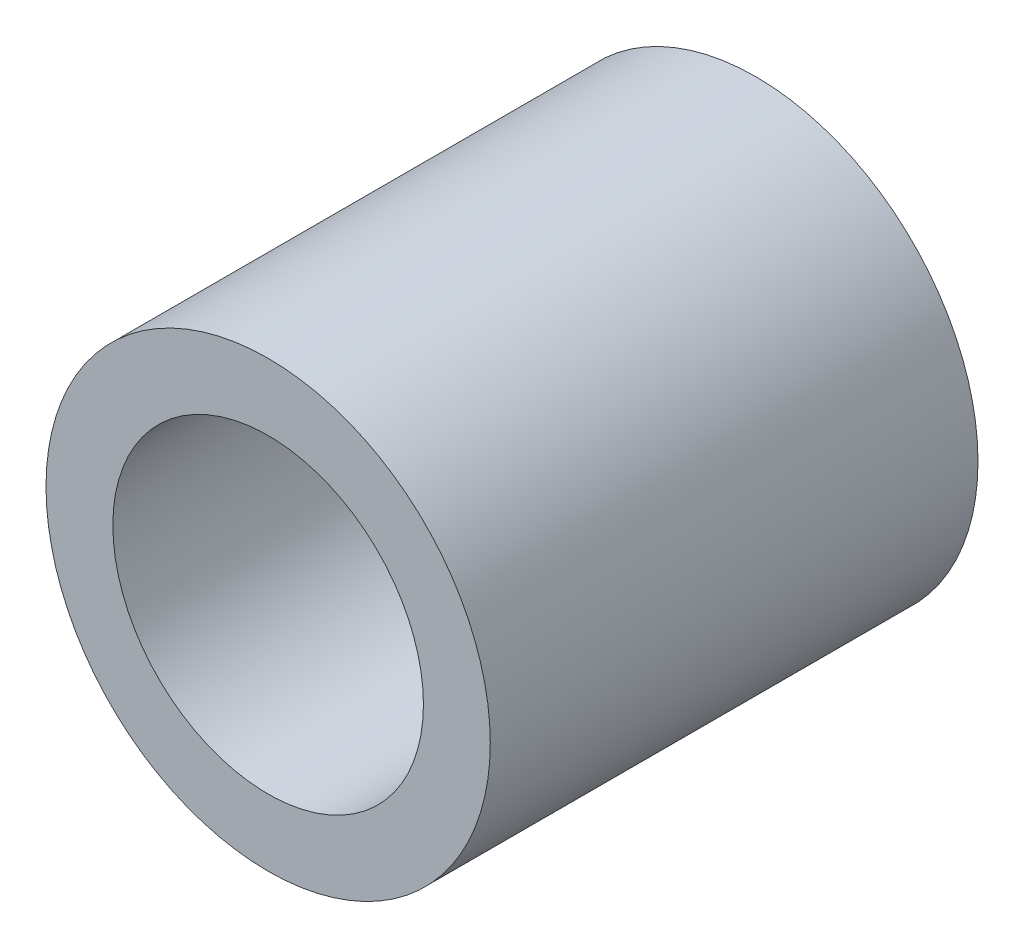
ISO-10303-21;
HEADER;
FILE_DESCRIPTION(('STEP AP214'),'2;1');
FILE_NAME('part.step','',(''),(''),'','','');
FILE_SCHEMA(('AUTOMOTIVE_DESIGN { 1 0 10303 214 1 1 1 1 }'));
ENDSEC;
DATA;
#1=APPLICATION_CONTEXT('core data for automotive mechanical design processes');
#2=APPLICATION_PROTOCOL_DEFINITION('international standard','automotive_design',2000,#1);
#3=PRODUCT_CONTEXT('',#1,'mechanical');
#4=PRODUCT('Part','Part','',(#3));
#5=PRODUCT_RELATED_PRODUCT_CATEGORY('part','',(#4));
#6=PRODUCT_DEFINITION_FORMATION('','',#4);
#7=PRODUCT_DEFINITION_CONTEXT('part definition',#1,'design');
#8=PRODUCT_DEFINITION('design','',#6,#7);
#9=PRODUCT_DEFINITION_SHAPE('','',#8);
#10=(LENGTH_UNIT() NAMED_UNIT(*) SI_UNIT(.MILLI.,.METRE.));
#11=(NAMED_UNIT(*) PLANE_ANGLE_UNIT() SI_UNIT($,.RADIAN.));
#12=(NAMED_UNIT(*) SI_UNIT($,.STERADIAN.) SOLID_ANGLE_UNIT());
#13=UNCERTAINTY_MEASURE_WITH_UNIT(LENGTH_MEASURE(1.E-05),#10,'distance_accuracy_value','');
#14=(GEOMETRIC_REPRESENTATION_CONTEXT(3) GLOBAL_UNCERTAINTY_ASSIGNED_CONTEXT((#13)) GLOBAL_UNIT_ASSIGNED_CONTEXT((#10,
#11,#12)) REPRESENTATION_CONTEXT('',''));
#15=CARTESIAN_POINT('',(0.,0.,0.));
#16=DIRECTION('',(0.,0.,1.));
#17=DIRECTION('',(1.,0.,0.));
#18=AXIS2_PLACEMENT_3D('',#15,#16,#17);
#19=CARTESIAN_POINT('',(0.,0.,11.));
#20=DIRECTION('',(0.,0.,1.));
#21=DIRECTION('',(1.,0.,0.));
#22=AXIS2_PLACEMENT_3D('',#19,#20,#21);
#23=PLANE('',#22);
#24=CARTESIAN_POINT('',(0.,0.,11.));
#25=DIRECTION('',(0.,0.,1.));
#26=DIRECTION('',(1.,0.,0.));
#27=AXIS2_PLACEMENT_3D('',#24,#25,#26);
#28=CIRCLE('',#27,10.02);
#29=CARTESIAN_POINT('',(10.02,0.,11.));
#30=VERTEX_POINT('',#29);
#31=EDGE_CURVE('E10',#30,#30,#28,.T.);
#32=ORIENTED_EDGE('',*,*,#31,.T.);
#33=EDGE_LOOP('',(#32));
#34=FACE_BOUND('',#33,.T.);
#35=CARTESIAN_POINT('',(0.,0.,11.));
#36=DIRECTION('',(0.,0.,1.));
#37=DIRECTION('',(1.,0.,0.));
#38=AXIS2_PLACEMENT_3D('',#35,#36,#37);
#39=CIRCLE('',#38,7.005);
#40=CARTESIAN_POINT('',(7.005,0.,11.));
#41=VERTEX_POINT('',#40);
#42=EDGE_CURVE('E49',#41,#41,#39,.T.);
#43=ORIENTED_EDGE('',*,*,#42,.F.);
#44=EDGE_LOOP('',(#43));
#45=FACE_BOUND('',#44,.T.);
#46=ADVANCED_FACE('F36',(#34,#45),#23,.T.);
#47=CARTESIAN_POINT('',(0.,0.,-11.));
#48=DIRECTION('',(0.,0.,1.));
#49=DIRECTION('',(1.,0.,0.));
#50=AXIS2_PLACEMENT_3D('',#47,#48,#49);
#51=PLANE('',#50);
#52=CARTESIAN_POINT('',(0.,0.,-11.));
#53=DIRECTION('',(0.,0.,1.));
#54=DIRECTION('',(1.,0.,0.));
#55=AXIS2_PLACEMENT_3D('',#52,#53,#54);
#56=CIRCLE('',#55,10.02);
#57=CARTESIAN_POINT('',(10.02,0.,-11.));
#58=VERTEX_POINT('',#57);
#59=EDGE_CURVE('E40',#58,#58,#56,.T.);
#60=ORIENTED_EDGE('',*,*,#59,.F.);
#61=EDGE_LOOP('',(#60));
#62=FACE_BOUND('',#61,.T.);
#63=CARTESIAN_POINT('',(0.,0.,-11.));
#64=DIRECTION('',(0.,0.,1.));
#65=DIRECTION('',(1.,0.,0.));
#66=AXIS2_PLACEMENT_3D('',#63,#64,#65);
#67=CIRCLE('',#66,7.005);
#68=CARTESIAN_POINT('',(7.005,0.,-11.));
#69=VERTEX_POINT('',#68);
#70=EDGE_CURVE('E51',#69,#69,#67,.T.);
#71=ORIENTED_EDGE('',*,*,#70,.T.);
#72=EDGE_LOOP('',(#71));
#73=FACE_BOUND('',#72,.T.);
#74=ADVANCED_FACE('F61',(#62,#73),#51,.F.);
#75=CARTESIAN_POINT('',(0.,0.,11.));
#76=DIRECTION('',(0.,0.,-1.));
#77=DIRECTION('',(-1.,0.,0.));
#78=AXIS2_PLACEMENT_3D('',#75,#76,#77);
#79=CYLINDRICAL_SURFACE('',#78,10.02);
#80=ORIENTED_EDGE('',*,*,#31,.F.);
#81=EDGE_LOOP('',(#80));
#82=FACE_BOUND('',#81,.T.);
#83=ORIENTED_EDGE('',*,*,#59,.T.);
#84=EDGE_LOOP('',(#83));
#85=FACE_BOUND('',#84,.T.);
#86=ADVANCED_FACE('F38',(#82,#85),#79,.T.);
#87=CARTESIAN_POINT('',(0.,0.,11.));
#88=DIRECTION('',(0.,0.,-1.));
#89=DIRECTION('',(-1.,0.,0.));
#90=AXIS2_PLACEMENT_3D('',#87,#88,#89);
#91=CYLINDRICAL_SURFACE('',#90,7.005);
#92=ORIENTED_EDGE('',*,*,#42,.T.);
#93=EDGE_LOOP('',(#92));
#94=FACE_BOUND('',#93,.T.);
#95=ORIENTED_EDGE('',*,*,#70,.F.);
#96=EDGE_LOOP('',(#95));
#97=FACE_BOUND('',#96,.T.);
#98=ADVANCED_FACE('F57',(#94,#97),#91,.F.);
#99=CLOSED_SHELL('',(#46,#74,#86,#98));
#100=MANIFOLD_SOLID_BREP('B2',#99);
#101=ADVANCED_BREP_SHAPE_REPRESENTATION('',(#18,#100),#14);
#102=SHAPE_DEFINITION_REPRESENTATION(#9,#101);
ENDSEC;
END-ISO-10303-21;
